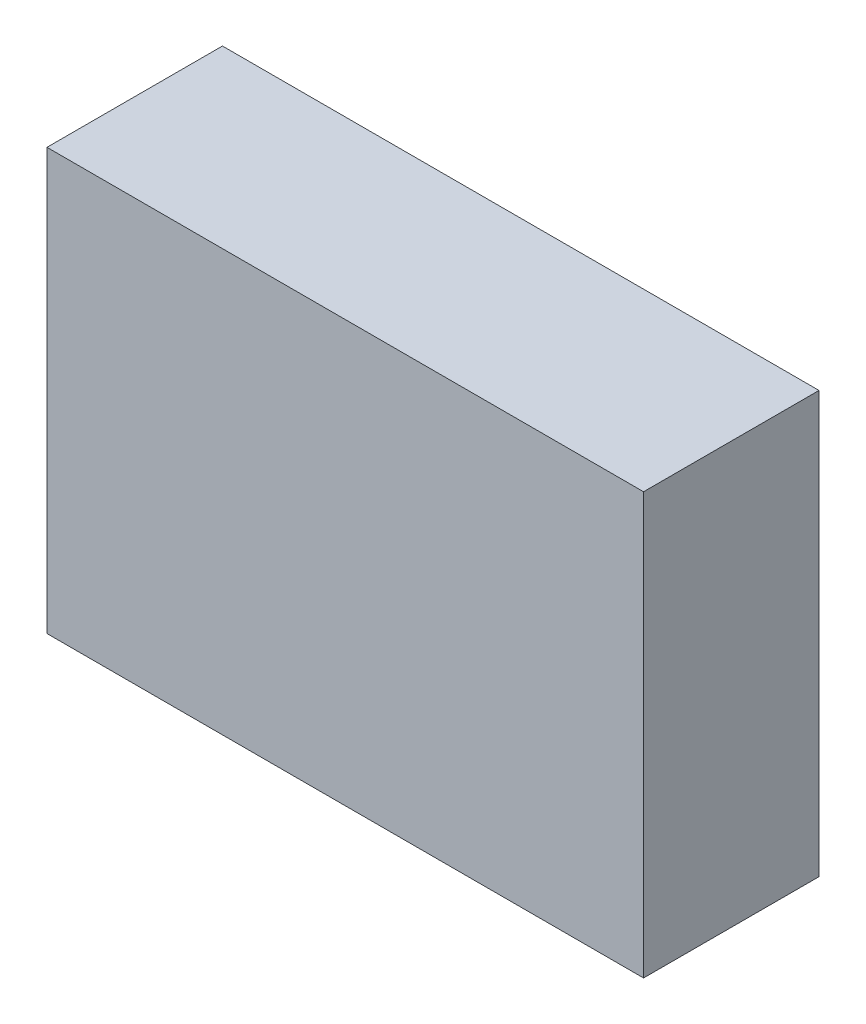
ISO-10303-21;
HEADER;
FILE_DESCRIPTION(('STEP AP214'),'2;1');
FILE_NAME('part.step','',(''),(''),'','','');
FILE_SCHEMA(('AUTOMOTIVE_DESIGN { 1 0 10303 214 1 1 1 1 }'));
ENDSEC;
DATA;
#1=APPLICATION_CONTEXT('core data for automotive mechanical design processes');
#2=APPLICATION_PROTOCOL_DEFINITION('international standard','automotive_design',2000,#1);
#3=PRODUCT_CONTEXT('',#1,'mechanical');
#4=PRODUCT('Part','Part','',(#3));
#5=PRODUCT_RELATED_PRODUCT_CATEGORY('part','',(#4));
#6=PRODUCT_DEFINITION_FORMATION('','',#4);
#7=PRODUCT_DEFINITION_CONTEXT('part definition',#1,'design');
#8=PRODUCT_DEFINITION('design','',#6,#7);
#9=PRODUCT_DEFINITION_SHAPE('','',#8);
#10=(LENGTH_UNIT() NAMED_UNIT(*) SI_UNIT(.MILLI.,.METRE.));
#11=(NAMED_UNIT(*) PLANE_ANGLE_UNIT() SI_UNIT($,.RADIAN.));
#12=(NAMED_UNIT(*) SI_UNIT($,.STERADIAN.) SOLID_ANGLE_UNIT());
#13=UNCERTAINTY_MEASURE_WITH_UNIT(LENGTH_MEASURE(1.E-05),#10,'distance_accuracy_value','');
#14=(GEOMETRIC_REPRESENTATION_CONTEXT(3) GLOBAL_UNCERTAINTY_ASSIGNED_CONTEXT((#13)) GLOBAL_UNIT_ASSIGNED_CONTEXT((#10,
#11,#12)) REPRESENTATION_CONTEXT('',''));
#15=CARTESIAN_POINT('',(0.,0.,0.));
#16=DIRECTION('',(0.,0.,1.));
#17=DIRECTION('',(1.,0.,0.));
#18=AXIS2_PLACEMENT_3D('',#15,#16,#17);
#19=CARTESIAN_POINT('',(2.58,0.63,0.));
#20=DIRECTION('',(1.,0.,0.));
#21=DIRECTION('',(0.,0.,1.));
#22=AXIS2_PLACEMENT_3D('',#19,#20,#21);
#23=PLANE('',#22);
#24=DIRECTION('',(0.,1.,0.));
#25=VECTOR('',#24,1.);
#26=CARTESIAN_POINT('',(2.58,0.63,0.1));
#27=LINE('',#26,#25);
#28=CARTESIAN_POINT('',(2.58,0.63,0.1));
#29=VERTEX_POINT('',#28);
#30=CARTESIAN_POINT('',(2.58,0.87,0.1));
#31=VERTEX_POINT('',#30);
#32=EDGE_CURVE('E11',#29,#31,#27,.T.);
#33=ORIENTED_EDGE('',*,*,#32,.T.);
#34=DIRECTION('',(0.,0.,1.));
#35=VECTOR('',#34,1.);
#36=CARTESIAN_POINT('',(2.58,0.87,0.));
#37=LINE('',#36,#35);
#38=CARTESIAN_POINT('',(2.58,0.87,0.));
#39=VERTEX_POINT('',#38);
#40=EDGE_CURVE('E24',#39,#31,#37,.T.);
#41=ORIENTED_EDGE('',*,*,#40,.F.);
#42=DIRECTION('',(0.,1.,0.));
#43=VECTOR('',#42,1.);
#44=CARTESIAN_POINT('',(2.58,0.63,0.));
#45=LINE('',#44,#43);
#46=CARTESIAN_POINT('',(2.58,0.63,0.));
#47=VERTEX_POINT('',#46);
#48=EDGE_CURVE('E86',#47,#39,#45,.T.);
#49=ORIENTED_EDGE('',*,*,#48,.F.);
#50=DIRECTION('',(0.,0.,1.));
#51=VECTOR('',#50,1.);
#52=CARTESIAN_POINT('',(2.58,0.63,0.));
#53=LINE('',#52,#51);
#54=EDGE_CURVE('E36',#47,#29,#53,.T.);
#55=ORIENTED_EDGE('',*,*,#54,.T.);
#56=EDGE_LOOP('',(#33,#41,#49,#55));
#57=FACE_BOUND('',#56,.T.);
#58=ADVANCED_FACE('F17',(#57),#23,.F.);
#59=CARTESIAN_POINT('',(2.92,0.63,0.));
#60=DIRECTION('',(1.,0.,0.));
#61=DIRECTION('',(0.,0.,1.));
#62=AXIS2_PLACEMENT_3D('',#59,#60,#61);
#63=PLANE('',#62);
#64=DIRECTION('',(0.,0.,1.));
#65=VECTOR('',#64,1.);
#66=CARTESIAN_POINT('',(2.92,0.63,0.));
#67=LINE('',#66,#65);
#68=CARTESIAN_POINT('',(2.92,0.63,0.));
#69=VERTEX_POINT('',#68);
#70=CARTESIAN_POINT('',(2.92,0.63,0.1));
#71=VERTEX_POINT('',#70);
#72=EDGE_CURVE('E83',#69,#71,#67,.T.);
#73=ORIENTED_EDGE('',*,*,#72,.F.);
#74=DIRECTION('',(0.,1.,0.));
#75=VECTOR('',#74,1.);
#76=CARTESIAN_POINT('',(2.92,0.63,0.));
#77=LINE('',#76,#75);
#78=CARTESIAN_POINT('',(2.92,0.87,0.));
#79=VERTEX_POINT('',#78);
#80=EDGE_CURVE('E63',#69,#79,#77,.T.);
#81=ORIENTED_EDGE('',*,*,#80,.T.);
#82=DIRECTION('',(0.,0.,1.));
#83=VECTOR('',#82,1.);
#84=CARTESIAN_POINT('',(2.92,0.87,0.));
#85=LINE('',#84,#83);
#86=CARTESIAN_POINT('',(2.92,0.87,0.1));
#87=VERTEX_POINT('',#86);
#88=EDGE_CURVE('E57',#79,#87,#85,.T.);
#89=ORIENTED_EDGE('',*,*,#88,.T.);
#90=DIRECTION('',(0.,1.,0.));
#91=VECTOR('',#90,1.);
#92=CARTESIAN_POINT('',(2.92,0.63,0.1));
#93=LINE('',#92,#91);
#94=EDGE_CURVE('E60',#71,#87,#93,.T.);
#95=ORIENTED_EDGE('',*,*,#94,.F.);
#96=EDGE_LOOP('',(#73,#81,#89,#95));
#97=FACE_BOUND('',#96,.T.);
#98=ADVANCED_FACE('F59',(#97),#63,.T.);
#99=CARTESIAN_POINT('',(2.58,0.63,0.));
#100=DIRECTION('',(0.,1.,0.));
#101=DIRECTION('',(0.,0.,1.));
#102=AXIS2_PLACEMENT_3D('',#99,#100,#101);
#103=PLANE('',#102);
#104=ORIENTED_EDGE('',*,*,#72,.T.);
#105=DIRECTION('',(1.,0.,0.));
#106=VECTOR('',#105,1.);
#107=CARTESIAN_POINT('',(2.58,0.63,0.1));
#108=LINE('',#107,#106);
#109=EDGE_CURVE('E71',#29,#71,#108,.T.);
#110=ORIENTED_EDGE('',*,*,#109,.F.);
#111=ORIENTED_EDGE('',*,*,#54,.F.);
#112=DIRECTION('',(1.,0.,0.));
#113=VECTOR('',#112,1.);
#114=CARTESIAN_POINT('',(2.58,0.63,0.));
#115=LINE('',#114,#113);
#116=EDGE_CURVE('E76',#47,#69,#115,.T.);
#117=ORIENTED_EDGE('',*,*,#116,.T.);
#118=EDGE_LOOP('',(#104,#110,#111,#117));
#119=FACE_BOUND('',#118,.T.);
#120=ADVANCED_FACE('F91',(#119),#103,.F.);
#121=CARTESIAN_POINT('',(2.58,0.87,0.));
#122=DIRECTION('',(0.,1.,0.));
#123=DIRECTION('',(0.,0.,1.));
#124=AXIS2_PLACEMENT_3D('',#121,#122,#123);
#125=PLANE('',#124);
#126=DIRECTION('',(1.,0.,0.));
#127=VECTOR('',#126,1.);
#128=CARTESIAN_POINT('',(2.58,0.87,0.));
#129=LINE('',#128,#127);
#130=EDGE_CURVE('E74',#39,#79,#129,.T.);
#131=ORIENTED_EDGE('',*,*,#130,.F.);
#132=ORIENTED_EDGE('',*,*,#40,.T.);
#133=DIRECTION('',(1.,0.,0.));
#134=VECTOR('',#133,1.);
#135=CARTESIAN_POINT('',(2.58,0.87,0.1));
#136=LINE('',#135,#134);
#137=EDGE_CURVE('E69',#31,#87,#136,.T.);
#138=ORIENTED_EDGE('',*,*,#137,.T.);
#139=ORIENTED_EDGE('',*,*,#88,.F.);
#140=EDGE_LOOP('',(#131,#132,#138,#139));
#141=FACE_BOUND('',#140,.T.);
#142=ADVANCED_FACE('F73',(#141),#125,.T.);
#143=CARTESIAN_POINT('',(2.58,0.63,0.));
#144=DIRECTION('',(0.,0.,1.));
#145=DIRECTION('',(1.,0.,0.));
#146=AXIS2_PLACEMENT_3D('',#143,#144,#145);
#147=PLANE('',#146);
#148=ORIENTED_EDGE('',*,*,#130,.T.);
#149=ORIENTED_EDGE('',*,*,#80,.F.);
#150=ORIENTED_EDGE('',*,*,#116,.F.);
#151=ORIENTED_EDGE('',*,*,#48,.T.);
#152=EDGE_LOOP('',(#148,#149,#150,#151));
#153=FACE_BOUND('',#152,.T.);
#154=ADVANCED_FACE('F89',(#153),#147,.F.);
#155=CARTESIAN_POINT('',(2.58,0.63,0.1));
#156=DIRECTION('',(0.,0.,1.));
#157=DIRECTION('',(1.,0.,0.));
#158=AXIS2_PLACEMENT_3D('',#155,#156,#157);
#159=PLANE('',#158);
#160=ORIENTED_EDGE('',*,*,#32,.F.);
#161=ORIENTED_EDGE('',*,*,#109,.T.);
#162=ORIENTED_EDGE('',*,*,#94,.T.);
#163=ORIENTED_EDGE('',*,*,#137,.F.);
#164=EDGE_LOOP('',(#160,#161,#162,#163));
#165=FACE_BOUND('',#164,.T.);
#166=ADVANCED_FACE('F68',(#165),#159,.T.);
#167=CLOSED_SHELL('',(#58,#98,#120,#142,#154,#166));
#168=MANIFOLD_SOLID_BREP('B1',#167);
#169=ADVANCED_BREP_SHAPE_REPRESENTATION('',(#18,#168),#14);
#170=SHAPE_DEFINITION_REPRESENTATION(#9,#169);
ENDSEC;
END-ISO-10303-21;
